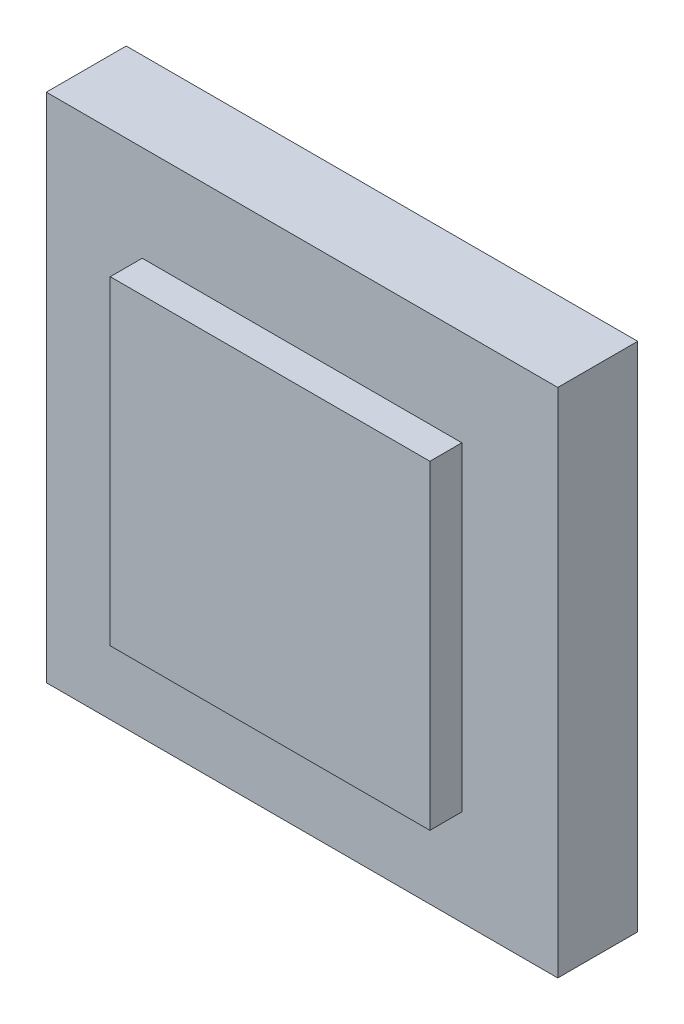
ISO-10303-21;
HEADER;
FILE_DESCRIPTION(('STEP AP214'),'2;1');
FILE_NAME('part.step','',(''),(''),'','','');
FILE_SCHEMA(('AUTOMOTIVE_DESIGN { 1 0 10303 214 1 1 1 1 }'));
ENDSEC;
DATA;
#1=APPLICATION_CONTEXT('core data for automotive mechanical design processes');
#2=APPLICATION_PROTOCOL_DEFINITION('international standard','automotive_design',2000,#1);
#3=PRODUCT_CONTEXT('',#1,'mechanical');
#4=PRODUCT('Part','Part','',(#3));
#5=PRODUCT_RELATED_PRODUCT_CATEGORY('part','',(#4));
#6=PRODUCT_DEFINITION_FORMATION('','',#4);
#7=PRODUCT_DEFINITION_CONTEXT('part definition',#1,'design');
#8=PRODUCT_DEFINITION('design','',#6,#7);
#9=PRODUCT_DEFINITION_SHAPE('','',#8);
#10=(LENGTH_UNIT() NAMED_UNIT(*) SI_UNIT(.MILLI.,.METRE.));
#11=(NAMED_UNIT(*) PLANE_ANGLE_UNIT() SI_UNIT($,.RADIAN.));
#12=(NAMED_UNIT(*) SI_UNIT($,.STERADIAN.) SOLID_ANGLE_UNIT());
#13=UNCERTAINTY_MEASURE_WITH_UNIT(LENGTH_MEASURE(1.E-05),#10,'distance_accuracy_value','');
#14=(GEOMETRIC_REPRESENTATION_CONTEXT(3) GLOBAL_UNCERTAINTY_ASSIGNED_CONTEXT((#13)) GLOBAL_UNIT_ASSIGNED_CONTEXT((#10,
#11,#12)) REPRESENTATION_CONTEXT('',''));
#15=CARTESIAN_POINT('',(0.,0.,0.));
#16=DIRECTION('',(0.,0.,1.));
#17=DIRECTION('',(1.,0.,0.));
#18=AXIS2_PLACEMENT_3D('',#15,#16,#17);
#19=CARTESIAN_POINT('',(0.,0.,63.5));
#20=DIRECTION('',(0.,0.,-1.));
#21=DIRECTION('',(-1.,0.,0.));
#22=AXIS2_PLACEMENT_3D('',#19,#20,#21);
#23=PLANE('',#22);
#24=DIRECTION('',(-1.,0.,0.));
#25=VECTOR('',#24,1.);
#26=CARTESIAN_POINT('',(203.2,-203.2,63.5));
#27=LINE('',#26,#25);
#28=CARTESIAN_POINT('',(203.2,-203.2,63.5));
#29=VERTEX_POINT('',#28);
#30=CARTESIAN_POINT('',(-203.2,-203.2,63.5));
#31=VERTEX_POINT('',#30);
#32=EDGE_CURVE('E128',#29,#31,#27,.T.);
#33=ORIENTED_EDGE('',*,*,#32,.F.);
#34=DIRECTION('',(0.,1.,0.));
#35=VECTOR('',#34,1.);
#36=CARTESIAN_POINT('',(203.2,-203.2,63.5));
#37=LINE('',#36,#35);
#38=CARTESIAN_POINT('',(203.2,203.2,63.5));
#39=VERTEX_POINT('',#38);
#40=EDGE_CURVE('E137',#29,#39,#37,.T.);
#41=ORIENTED_EDGE('',*,*,#40,.T.);
#42=DIRECTION('',(-1.,0.,0.));
#43=VECTOR('',#42,1.);
#44=CARTESIAN_POINT('',(203.2,203.2,63.5));
#45=LINE('',#44,#43);
#46=CARTESIAN_POINT('',(-203.2,203.2,63.5));
#47=VERTEX_POINT('',#46);
#48=EDGE_CURVE('E135',#39,#47,#45,.T.);
#49=ORIENTED_EDGE('',*,*,#48,.T.);
#50=DIRECTION('',(0.,1.,0.));
#51=VECTOR('',#50,1.);
#52=CARTESIAN_POINT('',(-203.2,-203.2,63.5));
#53=LINE('',#52,#51);
#54=EDGE_CURVE('E131',#31,#47,#53,.T.);
#55=ORIENTED_EDGE('',*,*,#54,.F.);
#56=EDGE_LOOP('',(#33,#41,#49,#55));
#57=FACE_BOUND('',#56,.T.);
#58=DIRECTION('',(0.,-1.,0.));
#59=VECTOR('',#58,1.);
#60=CARTESIAN_POINT('',(-127.,-127.,63.5));
#61=LINE('',#60,#59);
#62=CARTESIAN_POINT('',(-127.,127.,63.5));
#63=VERTEX_POINT('',#62);
#64=CARTESIAN_POINT('',(-127.,-127.,63.5));
#65=VERTEX_POINT('',#64);
#66=EDGE_CURVE('E50',#63,#65,#61,.T.);
#67=ORIENTED_EDGE('',*,*,#66,.F.);
#68=DIRECTION('',(-1.,0.,0.));
#69=VECTOR('',#68,1.);
#70=CARTESIAN_POINT('',(127.,127.,63.5));
#71=LINE('',#70,#69);
#72=CARTESIAN_POINT('',(127.,127.,63.5));
#73=VERTEX_POINT('',#72);
#74=EDGE_CURVE('E54',#73,#63,#71,.T.);
#75=ORIENTED_EDGE('',*,*,#74,.F.);
#76=DIRECTION('',(0.,1.,0.));
#77=VECTOR('',#76,1.);
#78=CARTESIAN_POINT('',(127.,-127.,63.5));
#79=LINE('',#78,#77);
#80=CARTESIAN_POINT('',(127.,-127.,63.5));
#81=VERTEX_POINT('',#80);
#82=EDGE_CURVE('E260',#81,#73,#79,.T.);
#83=ORIENTED_EDGE('',*,*,#82,.F.);
#84=DIRECTION('',(1.,0.,0.));
#85=VECTOR('',#84,1.);
#86=CARTESIAN_POINT('',(127.,-127.,63.5));
#87=LINE('',#86,#85);
#88=EDGE_CURVE('E266',#65,#81,#87,.T.);
#89=ORIENTED_EDGE('',*,*,#88,.F.);
#90=EDGE_LOOP('',(#67,#75,#83,#89));
#91=FACE_BOUND('',#90,.T.);
#92=ADVANCED_FACE('F33',(#57,#91),#23,.F.);
#93=CARTESIAN_POINT('',(203.2,-203.2,63.5));
#94=DIRECTION('',(0.,-1.,0.));
#95=DIRECTION('',(1.,0.,0.));
#96=AXIS2_PLACEMENT_3D('',#93,#94,#95);
#97=PLANE('',#96);
#98=DIRECTION('',(-1.,0.,0.));
#99=VECTOR('',#98,1.);
#100=CARTESIAN_POINT('',(203.2,-203.2,0.));
#101=LINE('',#100,#99);
#102=CARTESIAN_POINT('',(203.2,-203.2,0.));
#103=VERTEX_POINT('',#102);
#104=CARTESIAN_POINT('',(-203.2,-203.2,0.));
#105=VERTEX_POINT('',#104);
#106=EDGE_CURVE('E119',#103,#105,#101,.T.);
#107=ORIENTED_EDGE('',*,*,#106,.F.);
#108=DIRECTION('',(0.,0.,-1.));
#109=VECTOR('',#108,1.);
#110=CARTESIAN_POINT('',(203.2,-203.2,63.5));
#111=LINE('',#110,#109);
#112=EDGE_CURVE('E11',#29,#103,#111,.T.);
#113=ORIENTED_EDGE('',*,*,#112,.F.);
#114=ORIENTED_EDGE('',*,*,#32,.T.);
#115=DIRECTION('',(0.,0.,-1.));
#116=VECTOR('',#115,1.);
#117=CARTESIAN_POINT('',(-203.2,-203.2,63.5));
#118=LINE('',#117,#116);
#119=EDGE_CURVE('E37',#31,#105,#118,.T.);
#120=ORIENTED_EDGE('',*,*,#119,.T.);
#121=EDGE_LOOP('',(#107,#113,#114,#120));
#122=FACE_BOUND('',#121,.T.);
#123=ADVANCED_FACE('F35',(#122),#97,.T.);
#124=CARTESIAN_POINT('',(203.2,-203.2,63.5));
#125=DIRECTION('',(-1.,0.,0.));
#126=DIRECTION('',(0.,0.,1.));
#127=AXIS2_PLACEMENT_3D('',#124,#125,#126);
#128=PLANE('',#127);
#129=DIRECTION('',(0.,1.,0.));
#130=VECTOR('',#129,1.);
#131=CARTESIAN_POINT('',(203.2,-203.2,0.));
#132=LINE('',#131,#130);
#133=CARTESIAN_POINT('',(203.2,203.2,0.));
#134=VERTEX_POINT('',#133);
#135=EDGE_CURVE('E132',#103,#134,#132,.T.);
#136=ORIENTED_EDGE('',*,*,#135,.T.);
#137=DIRECTION('',(0.,0.,-1.));
#138=VECTOR('',#137,1.);
#139=CARTESIAN_POINT('',(203.2,203.2,63.5));
#140=LINE('',#139,#138);
#141=EDGE_CURVE('E42',#39,#134,#140,.T.);
#142=ORIENTED_EDGE('',*,*,#141,.F.);
#143=ORIENTED_EDGE('',*,*,#40,.F.);
#144=ORIENTED_EDGE('',*,*,#112,.T.);
#145=EDGE_LOOP('',(#136,#142,#143,#144));
#146=FACE_BOUND('',#145,.T.);
#147=ADVANCED_FACE('F161',(#146),#128,.F.);
#148=CARTESIAN_POINT('',(203.2,203.2,63.5));
#149=DIRECTION('',(0.,-1.,0.));
#150=DIRECTION('',(1.,0.,0.));
#151=AXIS2_PLACEMENT_3D('',#148,#149,#150);
#152=PLANE('',#151);
#153=DIRECTION('',(-1.,0.,0.));
#154=VECTOR('',#153,1.);
#155=CARTESIAN_POINT('',(203.2,203.2,0.));
#156=LINE('',#155,#154);
#157=CARTESIAN_POINT('',(-203.2,203.2,0.));
#158=VERTEX_POINT('',#157);
#159=EDGE_CURVE('E141',#134,#158,#156,.T.);
#160=ORIENTED_EDGE('',*,*,#159,.T.);
#161=DIRECTION('',(0.,0.,-1.));
#162=VECTOR('',#161,1.);
#163=CARTESIAN_POINT('',(-203.2,203.2,63.5));
#164=LINE('',#163,#162);
#165=EDGE_CURVE('E146',#47,#158,#164,.T.);
#166=ORIENTED_EDGE('',*,*,#165,.F.);
#167=ORIENTED_EDGE('',*,*,#48,.F.);
#168=ORIENTED_EDGE('',*,*,#141,.T.);
#169=EDGE_LOOP('',(#160,#166,#167,#168));
#170=FACE_BOUND('',#169,.T.);
#171=ADVANCED_FACE('F165',(#170),#152,.F.);
#172=CARTESIAN_POINT('',(-203.2,-203.2,63.5));
#173=DIRECTION('',(-1.,0.,0.));
#174=DIRECTION('',(0.,0.,1.));
#175=AXIS2_PLACEMENT_3D('',#172,#173,#174);
#176=PLANE('',#175);
#177=DIRECTION('',(0.,1.,0.));
#178=VECTOR('',#177,1.);
#179=CARTESIAN_POINT('',(-203.2,-203.2,0.));
#180=LINE('',#179,#178);
#181=EDGE_CURVE('E122',#105,#158,#180,.T.);
#182=ORIENTED_EDGE('',*,*,#181,.F.);
#183=ORIENTED_EDGE('',*,*,#119,.F.);
#184=ORIENTED_EDGE('',*,*,#54,.T.);
#185=ORIENTED_EDGE('',*,*,#165,.T.);
#186=EDGE_LOOP('',(#182,#183,#184,#185));
#187=FACE_BOUND('',#186,.T.);
#188=ADVANCED_FACE('F154',(#187),#176,.T.);
#189=CARTESIAN_POINT('',(0.,0.,0.));
#190=DIRECTION('',(0.,0.,-1.));
#191=DIRECTION('',(-1.,0.,0.));
#192=AXIS2_PLACEMENT_3D('',#189,#190,#191);
#193=PLANE('',#192);
#194=ORIENTED_EDGE('',*,*,#106,.T.);
#195=ORIENTED_EDGE('',*,*,#181,.T.);
#196=ORIENTED_EDGE('',*,*,#159,.F.);
#197=ORIENTED_EDGE('',*,*,#135,.F.);
#198=EDGE_LOOP('',(#194,#195,#196,#197));
#199=FACE_BOUND('',#198,.T.);
#200=ADVANCED_FACE('F158',(#199),#193,.T.);
#201=CARTESIAN_POINT('',(-127.,-127.,88.9));
#202=DIRECTION('',(1.,0.,0.));
#203=DIRECTION('',(0.,0.,-1.));
#204=AXIS2_PLACEMENT_3D('',#201,#202,#203);
#205=PLANE('',#204);
#206=ORIENTED_EDGE('',*,*,#66,.T.);
#207=DIRECTION('',(0.,0.,-1.));
#208=VECTOR('',#207,1.);
#209=CARTESIAN_POINT('',(-127.,-127.,88.9));
#210=LINE('',#209,#208);
#211=CARTESIAN_POINT('',(-127.,-127.,88.9));
#212=VERTEX_POINT('',#211);
#213=EDGE_CURVE('E102',#212,#65,#210,.T.);
#214=ORIENTED_EDGE('',*,*,#213,.F.);
#215=DIRECTION('',(0.,-1.,0.));
#216=VECTOR('',#215,1.);
#217=CARTESIAN_POINT('',(-127.,-127.,88.9));
#218=LINE('',#217,#216);
#219=CARTESIAN_POINT('',(-127.,127.,88.9));
#220=VERTEX_POINT('',#219);
#221=EDGE_CURVE('E108',#220,#212,#218,.T.);
#222=ORIENTED_EDGE('',*,*,#221,.F.);
#223=DIRECTION('',(0.,0.,-1.));
#224=VECTOR('',#223,1.);
#225=CARTESIAN_POINT('',(-127.,127.,88.9));
#226=LINE('',#225,#224);
#227=EDGE_CURVE('E258',#220,#63,#226,.T.);
#228=ORIENTED_EDGE('',*,*,#227,.T.);
#229=EDGE_LOOP('',(#206,#214,#222,#228));
#230=FACE_BOUND('',#229,.T.);
#231=ADVANCED_FACE('F118',(#230),#205,.F.);
#232=CARTESIAN_POINT('',(127.,-127.,88.9));
#233=DIRECTION('',(0.,1.,0.));
#234=DIRECTION('',(-1.,0.,0.));
#235=AXIS2_PLACEMENT_3D('',#232,#233,#234);
#236=PLANE('',#235);
#237=ORIENTED_EDGE('',*,*,#88,.T.);
#238=DIRECTION('',(0.,0.,-1.));
#239=VECTOR('',#238,1.);
#240=CARTESIAN_POINT('',(127.,-127.,88.9));
#241=LINE('',#240,#239);
#242=CARTESIAN_POINT('',(127.,-127.,88.9));
#243=VERTEX_POINT('',#242);
#244=EDGE_CURVE('E104',#243,#81,#241,.T.);
#245=ORIENTED_EDGE('',*,*,#244,.F.);
#246=DIRECTION('',(1.,0.,0.));
#247=VECTOR('',#246,1.);
#248=CARTESIAN_POINT('',(127.,-127.,88.9));
#249=LINE('',#248,#247);
#250=EDGE_CURVE('E97',#212,#243,#249,.T.);
#251=ORIENTED_EDGE('',*,*,#250,.F.);
#252=ORIENTED_EDGE('',*,*,#213,.T.);
#253=EDGE_LOOP('',(#237,#245,#251,#252));
#254=FACE_BOUND('',#253,.T.);
#255=ADVANCED_FACE('F100',(#254),#236,.F.);
#256=CARTESIAN_POINT('',(127.,-127.,88.9));
#257=DIRECTION('',(-1.,0.,0.));
#258=DIRECTION('',(0.,0.,1.));
#259=AXIS2_PLACEMENT_3D('',#256,#257,#258);
#260=PLANE('',#259);
#261=ORIENTED_EDGE('',*,*,#82,.T.);
#262=DIRECTION('',(0.,0.,-1.));
#263=VECTOR('',#262,1.);
#264=CARTESIAN_POINT('',(127.,127.,88.9));
#265=LINE('',#264,#263);
#266=CARTESIAN_POINT('',(127.,127.,88.9));
#267=VERTEX_POINT('',#266);
#268=EDGE_CURVE('E124',#267,#73,#265,.T.);
#269=ORIENTED_EDGE('',*,*,#268,.F.);
#270=DIRECTION('',(0.,1.,0.));
#271=VECTOR('',#270,1.);
#272=CARTESIAN_POINT('',(127.,-127.,88.9));
#273=LINE('',#272,#271);
#274=EDGE_CURVE('E107',#243,#267,#273,.T.);
#275=ORIENTED_EDGE('',*,*,#274,.F.);
#276=ORIENTED_EDGE('',*,*,#244,.T.);
#277=EDGE_LOOP('',(#261,#269,#275,#276));
#278=FACE_BOUND('',#277,.T.);
#279=ADVANCED_FACE('F200',(#278),#260,.F.);
#280=CARTESIAN_POINT('',(127.,127.,88.9));
#281=DIRECTION('',(0.,-1.,0.));
#282=DIRECTION('',(1.,0.,0.));
#283=AXIS2_PLACEMENT_3D('',#280,#281,#282);
#284=PLANE('',#283);
#285=ORIENTED_EDGE('',*,*,#74,.T.);
#286=ORIENTED_EDGE('',*,*,#227,.F.);
#287=DIRECTION('',(-1.,0.,0.));
#288=VECTOR('',#287,1.);
#289=CARTESIAN_POINT('',(127.,127.,88.9));
#290=LINE('',#289,#288);
#291=EDGE_CURVE('E113',#267,#220,#290,.T.);
#292=ORIENTED_EDGE('',*,*,#291,.F.);
#293=ORIENTED_EDGE('',*,*,#268,.T.);
#294=EDGE_LOOP('',(#285,#286,#292,#293));
#295=FACE_BOUND('',#294,.T.);
#296=ADVANCED_FACE('F206',(#295),#284,.F.);
#297=CARTESIAN_POINT('',(0.,0.,88.9));
#298=DIRECTION('',(0.,0.,1.));
#299=DIRECTION('',(1.,0.,0.));
#300=AXIS2_PLACEMENT_3D('',#297,#298,#299);
#301=PLANE('',#300);
#302=ORIENTED_EDGE('',*,*,#221,.T.);
#303=ORIENTED_EDGE('',*,*,#250,.T.);
#304=ORIENTED_EDGE('',*,*,#274,.T.);
#305=ORIENTED_EDGE('',*,*,#291,.T.);
#306=EDGE_LOOP('',(#302,#303,#304,#305));
#307=FACE_BOUND('',#306,.T.);
#308=ADVANCED_FACE('F111',(#307),#301,.T.);
#309=CLOSED_SHELL('',(#92,#123,#147,#171,#188,#200,#231,#255,#279,#296,#308));
#310=MANIFOLD_SOLID_BREP('B2',#309);
#311=ADVANCED_BREP_SHAPE_REPRESENTATION('',(#18,#310),#14);
#312=SHAPE_DEFINITION_REPRESENTATION(#9,#311);
ENDSEC;
END-ISO-10303-21;
